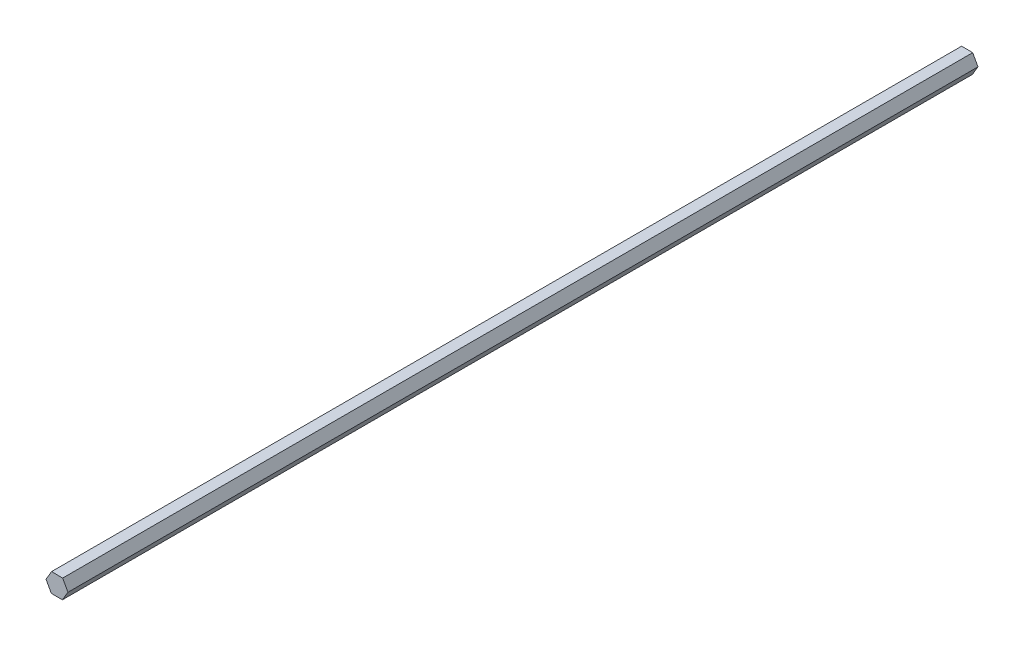
ISO-10303-21;
HEADER;
FILE_DESCRIPTION(('STEP AP214'),'2;1');
FILE_NAME('part.step','',(''),(''),'','','');
FILE_SCHEMA(('AUTOMOTIVE_DESIGN { 1 0 10303 214 1 1 1 1 }'));
ENDSEC;
DATA;
#1=APPLICATION_CONTEXT('core data for automotive mechanical design processes');
#2=APPLICATION_PROTOCOL_DEFINITION('international standard','automotive_design',2000,#1);
#3=PRODUCT_CONTEXT('',#1,'mechanical');
#4=PRODUCT('Part','Part','',(#3));
#5=PRODUCT_RELATED_PRODUCT_CATEGORY('part','',(#4));
#6=PRODUCT_DEFINITION_FORMATION('','',#4);
#7=PRODUCT_DEFINITION_CONTEXT('part definition',#1,'design');
#8=PRODUCT_DEFINITION('design','',#6,#7);
#9=PRODUCT_DEFINITION_SHAPE('','',#8);
#10=(LENGTH_UNIT() NAMED_UNIT(*) SI_UNIT(.MILLI.,.METRE.));
#11=(NAMED_UNIT(*) PLANE_ANGLE_UNIT() SI_UNIT($,.RADIAN.));
#12=(NAMED_UNIT(*) SI_UNIT($,.STERADIAN.) SOLID_ANGLE_UNIT());
#13=UNCERTAINTY_MEASURE_WITH_UNIT(LENGTH_MEASURE(1.E-05),#10,'distance_accuracy_value','');
#14=(GEOMETRIC_REPRESENTATION_CONTEXT(3) GLOBAL_UNCERTAINTY_ASSIGNED_CONTEXT((#13)) GLOBAL_UNIT_ASSIGNED_CONTEXT((#10,
#11,#12)) REPRESENTATION_CONTEXT('',''));
#15=CARTESIAN_POINT('',(0.,0.,0.));
#16=DIRECTION('',(0.,0.,1.));
#17=DIRECTION('',(1.,0.,0.));
#18=AXIS2_PLACEMENT_3D('',#15,#16,#17);
#19=CARTESIAN_POINT('',(-6.81785814980266,-2.38488515344229,558.8));
#20=DIRECTION('',(0.0164995224917249,0.999863873613576,0.));
#21=DIRECTION('',(-0.999863873613576,0.0164995224917249,0.));
#22=AXIS2_PLACEMENT_3D('',#19,#20,#21);
#23=PLANE('',#22);
#24=DIRECTION('',(0.999863873613576,-0.0164995224917249,0.));
#25=VECTOR('',#24,1.);
#26=CARTESIAN_POINT('',(-6.81785814980266,-2.38488515344229,0.));
#27=LINE('',#26,#25);
#28=CARTESIAN_POINT('',(-6.81785814980266,-2.38488515344229,0.));
#29=VERTEX_POINT('',#28);
#30=CARTESIAN_POINT('',(-0.072536491075809,-2.49619489205687,0.));
#31=VERTEX_POINT('',#30);
#32=EDGE_CURVE('E128',#29,#31,#27,.T.);
#33=ORIENTED_EDGE('',*,*,#32,.T.);
#34=DIRECTION('',(0.,0.,-1.));
#35=VECTOR('',#34,1.);
#36=CARTESIAN_POINT('',(-0.072536491075809,-2.49619489205687,558.8));
#37=LINE('',#36,#35);
#38=CARTESIAN_POINT('',(-0.072536491075809,-2.49619489205687,558.8));
#39=VERTEX_POINT('',#38);
#40=EDGE_CURVE('E11',#39,#31,#37,.T.);
#41=ORIENTED_EDGE('',*,*,#40,.F.);
#42=DIRECTION('',(0.999863873613576,-0.0164995224917249,0.));
#43=VECTOR('',#42,1.);
#44=CARTESIAN_POINT('',(-6.81785814980266,-2.38488515344229,558.8));
#45=LINE('',#44,#43);
#46=CARTESIAN_POINT('',(-6.81785814980266,-2.38488515344229,558.8));
#47=VERTEX_POINT('',#46);
#48=EDGE_CURVE('E144',#47,#39,#45,.T.);
#49=ORIENTED_EDGE('',*,*,#48,.F.);
#50=DIRECTION('',(0.,0.,-1.));
#51=VECTOR('',#50,1.);
#52=CARTESIAN_POINT('',(-6.81785814980266,-2.38488515344229,558.8));
#53=LINE('',#52,#51);
#54=EDGE_CURVE('E124',#47,#29,#53,.T.);
#55=ORIENTED_EDGE('',*,*,#54,.T.);
#56=EDGE_LOOP('',(#33,#41,#49,#55));
#57=FACE_BOUND('',#56,.T.);
#58=ADVANCED_FACE('F39',(#57),#23,.F.);
#59=CARTESIAN_POINT('',(-0.072536491075809,-2.49619489205687,558.8));
#60=DIRECTION('',(-0.857657753629808,0.514220942434934,0.));
#61=DIRECTION('',(-0.514220942434934,-0.857657753629808,0.));
#62=AXIS2_PLACEMENT_3D('',#59,#60,#61);
#63=PLANE('',#62);
#64=DIRECTION('',(0.514220942434934,0.857657753629808,0.));
#65=VECTOR('',#64,1.);
#66=CARTESIAN_POINT('',(-0.072536491075809,-2.49619489205687,0.));
#67=LINE('',#66,#65);
#68=CARTESIAN_POINT('',(3.39652139961644,3.28977015179068,0.));
#69=VERTEX_POINT('',#68);
#70=EDGE_CURVE('E132',#31,#69,#67,.T.);
#71=ORIENTED_EDGE('',*,*,#70,.T.);
#72=DIRECTION('',(0.,0.,-1.));
#73=VECTOR('',#72,1.);
#74=CARTESIAN_POINT('',(3.39652139961644,3.28977015179068,558.8));
#75=LINE('',#74,#73);
#76=CARTESIAN_POINT('',(3.39652139961644,3.28977015179068,558.8));
#77=VERTEX_POINT('',#76);
#78=EDGE_CURVE('E48',#77,#69,#75,.T.);
#79=ORIENTED_EDGE('',*,*,#78,.F.);
#80=DIRECTION('',(0.514220942434934,0.857657753629808,0.));
#81=VECTOR('',#80,1.);
#82=CARTESIAN_POINT('',(-0.072536491075809,-2.49619489205687,558.8));
#83=LINE('',#82,#81);
#84=EDGE_CURVE('E93',#39,#77,#83,.T.);
#85=ORIENTED_EDGE('',*,*,#84,.F.);
#86=ORIENTED_EDGE('',*,*,#40,.T.);
#87=EDGE_LOOP('',(#71,#79,#85,#86));
#88=FACE_BOUND('',#87,.T.);
#89=ADVANCED_FACE('F172',(#88),#63,.F.);
#90=CARTESIAN_POINT('',(3.39652139961644,3.28977015179068,558.8));
#91=DIRECTION('',(-0.874157276121533,-0.485642931178642,0.));
#92=DIRECTION('',(0.485642931178642,-0.874157276121533,0.));
#93=AXIS2_PLACEMENT_3D('',#90,#91,#92);
#94=PLANE('',#93);
#95=DIRECTION('',(-0.485642931178642,0.874157276121532,0.));
#96=VECTOR('',#95,1.);
#97=CARTESIAN_POINT('',(3.39652139961644,3.28977015179068,0.));
#98=LINE('',#97,#96);
#99=CARTESIAN_POINT('',(0.120257631581841,9.18704493425281,0.));
#100=VERTEX_POINT('',#99);
#101=EDGE_CURVE('E135',#69,#100,#98,.T.);
#102=ORIENTED_EDGE('',*,*,#101,.T.);
#103=DIRECTION('',(0.,0.,-1.));
#104=VECTOR('',#103,1.);
#105=CARTESIAN_POINT('',(0.120257631581841,9.18704493425281,558.8));
#106=LINE('',#105,#104);
#107=CARTESIAN_POINT('',(0.120257631581841,9.18704493425281,558.8));
#108=VERTEX_POINT('',#107);
#109=EDGE_CURVE('E117',#108,#100,#106,.T.);
#110=ORIENTED_EDGE('',*,*,#109,.F.);
#111=DIRECTION('',(-0.485642931178642,0.874157276121532,0.));
#112=VECTOR('',#111,1.);
#113=CARTESIAN_POINT('',(3.39652139961644,3.28977015179068,558.8));
#114=LINE('',#113,#112);
#115=EDGE_CURVE('E106',#77,#108,#114,.T.);
#116=ORIENTED_EDGE('',*,*,#115,.F.);
#117=ORIENTED_EDGE('',*,*,#78,.T.);
#118=EDGE_LOOP('',(#102,#110,#116,#117));
#119=FACE_BOUND('',#118,.T.);
#120=ADVANCED_FACE('F154',(#119),#94,.F.);
#121=CARTESIAN_POINT('',(0.120257631581841,9.18704493425281,558.8));
#122=DIRECTION('',(-0.016499522491725,-0.999863873613576,0.));
#123=DIRECTION('',(0.999863873613576,-0.016499522491725,0.));
#124=AXIS2_PLACEMENT_3D('',#121,#122,#123);
#125=PLANE('',#124);
#126=DIRECTION('',(-0.999863873613576,0.016499522491725,0.));
#127=VECTOR('',#126,1.);
#128=CARTESIAN_POINT('',(0.120257631581841,9.18704493425281,0.));
#129=LINE('',#128,#127);
#130=CARTESIAN_POINT('',(-6.625064027145,9.29835467286738,0.));
#131=VERTEX_POINT('',#130);
#132=EDGE_CURVE('E115',#100,#131,#129,.T.);
#133=ORIENTED_EDGE('',*,*,#132,.T.);
#134=DIRECTION('',(0.,0.,-1.));
#135=VECTOR('',#134,1.);
#136=CARTESIAN_POINT('',(-6.625064027145,9.29835467286738,558.8));
#137=LINE('',#136,#135);
#138=CARTESIAN_POINT('',(-6.625064027145,9.29835467286738,558.8));
#139=VERTEX_POINT('',#138);
#140=EDGE_CURVE('E112',#139,#131,#137,.T.);
#141=ORIENTED_EDGE('',*,*,#140,.F.);
#142=DIRECTION('',(-0.999863873613576,0.016499522491725,0.));
#143=VECTOR('',#142,1.);
#144=CARTESIAN_POINT('',(0.120257631581841,9.18704493425281,558.8));
#145=LINE('',#144,#143);
#146=EDGE_CURVE('E100',#108,#139,#145,.T.);
#147=ORIENTED_EDGE('',*,*,#146,.F.);
#148=ORIENTED_EDGE('',*,*,#109,.T.);
#149=EDGE_LOOP('',(#133,#141,#147,#148));
#150=FACE_BOUND('',#149,.T.);
#151=ADVANCED_FACE('F113',(#150),#125,.F.);
#152=CARTESIAN_POINT('',(-6.625064027145,9.29835467286738,558.8));
#153=DIRECTION('',(0.857657753629808,-0.514220942434934,0.));
#154=DIRECTION('',(0.514220942434934,0.857657753629808,0.));
#155=AXIS2_PLACEMENT_3D('',#152,#153,#154);
#156=PLANE('',#155);
#157=DIRECTION('',(-0.514220942434934,-0.857657753629808,0.));
#158=VECTOR('',#157,1.);
#159=CARTESIAN_POINT('',(-6.625064027145,9.29835467286738,0.));
#160=LINE('',#159,#158);
#161=CARTESIAN_POINT('',(-10.0941219178373,3.51238962901983,0.));
#162=VERTEX_POINT('',#161);
#163=EDGE_CURVE('E79',#131,#162,#160,.T.);
#164=ORIENTED_EDGE('',*,*,#163,.T.);
#165=DIRECTION('',(0.,0.,-1.));
#166=VECTOR('',#165,1.);
#167=CARTESIAN_POINT('',(-10.0941219178373,3.51238962901983,558.8));
#168=LINE('',#167,#166);
#169=CARTESIAN_POINT('',(-10.0941219178373,3.51238962901983,558.8));
#170=VERTEX_POINT('',#169);
#171=EDGE_CURVE('E118',#170,#162,#168,.T.);
#172=ORIENTED_EDGE('',*,*,#171,.F.);
#173=DIRECTION('',(-0.514220942434934,-0.857657753629808,0.));
#174=VECTOR('',#173,1.);
#175=CARTESIAN_POINT('',(-6.625064027145,9.29835467286738,558.8));
#176=LINE('',#175,#174);
#177=EDGE_CURVE('E104',#139,#170,#176,.T.);
#178=ORIENTED_EDGE('',*,*,#177,.F.);
#179=ORIENTED_EDGE('',*,*,#140,.T.);
#180=EDGE_LOOP('',(#164,#172,#178,#179));
#181=FACE_BOUND('',#180,.T.);
#182=ADVANCED_FACE('F120',(#181),#156,.F.);
#183=CARTESIAN_POINT('',(-10.0941219178373,3.51238962901983,558.8));
#184=DIRECTION('',(0.874157276121532,0.485642931178642,0.));
#185=DIRECTION('',(-0.485642931178642,0.874157276121532,0.));
#186=AXIS2_PLACEMENT_3D('',#183,#184,#185);
#187=PLANE('',#186);
#188=DIRECTION('',(0.485642931178642,-0.874157276121532,0.));
#189=VECTOR('',#188,1.);
#190=CARTESIAN_POINT('',(-10.0941219178373,3.51238962901983,0.));
#191=LINE('',#190,#189);
#192=EDGE_CURVE('E85',#162,#29,#191,.T.);
#193=ORIENTED_EDGE('',*,*,#192,.T.);
#194=ORIENTED_EDGE('',*,*,#54,.F.);
#195=DIRECTION('',(0.485642931178642,-0.874157276121532,0.));
#196=VECTOR('',#195,1.);
#197=CARTESIAN_POINT('',(-10.0941219178373,3.51238962901983,558.8));
#198=LINE('',#197,#196);
#199=EDGE_CURVE('E56',#170,#47,#198,.T.);
#200=ORIENTED_EDGE('',*,*,#199,.F.);
#201=ORIENTED_EDGE('',*,*,#171,.T.);
#202=EDGE_LOOP('',(#193,#194,#200,#201));
#203=FACE_BOUND('',#202,.T.);
#204=ADVANCED_FACE('F161',(#203),#187,.F.);
#205=CARTESIAN_POINT('',(0.,0.,558.8));
#206=DIRECTION('',(0.,0.,1.));
#207=DIRECTION('',(1.,0.,0.));
#208=AXIS2_PLACEMENT_3D('',#205,#206,#207);
#209=PLANE('',#208);
#210=ORIENTED_EDGE('',*,*,#48,.T.);
#211=ORIENTED_EDGE('',*,*,#84,.T.);
#212=ORIENTED_EDGE('',*,*,#115,.T.);
#213=ORIENTED_EDGE('',*,*,#146,.T.);
#214=ORIENTED_EDGE('',*,*,#177,.T.);
#215=ORIENTED_EDGE('',*,*,#199,.T.);
#216=EDGE_LOOP('',(#210,#211,#212,#213,#214,#215));
#217=FACE_BOUND('',#216,.T.);
#218=ADVANCED_FACE('F102',(#217),#209,.T.);
#219=CARTESIAN_POINT('',(0.,0.,0.));
#220=DIRECTION('',(0.,0.,1.));
#221=DIRECTION('',(1.,0.,0.));
#222=AXIS2_PLACEMENT_3D('',#219,#220,#221);
#223=PLANE('',#222);
#224=ORIENTED_EDGE('',*,*,#32,.F.);
#225=ORIENTED_EDGE('',*,*,#192,.F.);
#226=ORIENTED_EDGE('',*,*,#163,.F.);
#227=ORIENTED_EDGE('',*,*,#132,.F.);
#228=ORIENTED_EDGE('',*,*,#101,.F.);
#229=ORIENTED_EDGE('',*,*,#70,.F.);
#230=EDGE_LOOP('',(#224,#225,#226,#227,#228,#229));
#231=FACE_BOUND('',#230,.T.);
#232=ADVANCED_FACE('F157',(#231),#223,.F.);
#233=CLOSED_SHELL('',(#58,#89,#120,#151,#182,#204,#218,#232));
#234=MANIFOLD_SOLID_BREP('B2',#233);
#235=ADVANCED_BREP_SHAPE_REPRESENTATION('',(#18,#234),#14);
#236=SHAPE_DEFINITION_REPRESENTATION(#9,#235);
ENDSEC;
END-ISO-10303-21;
